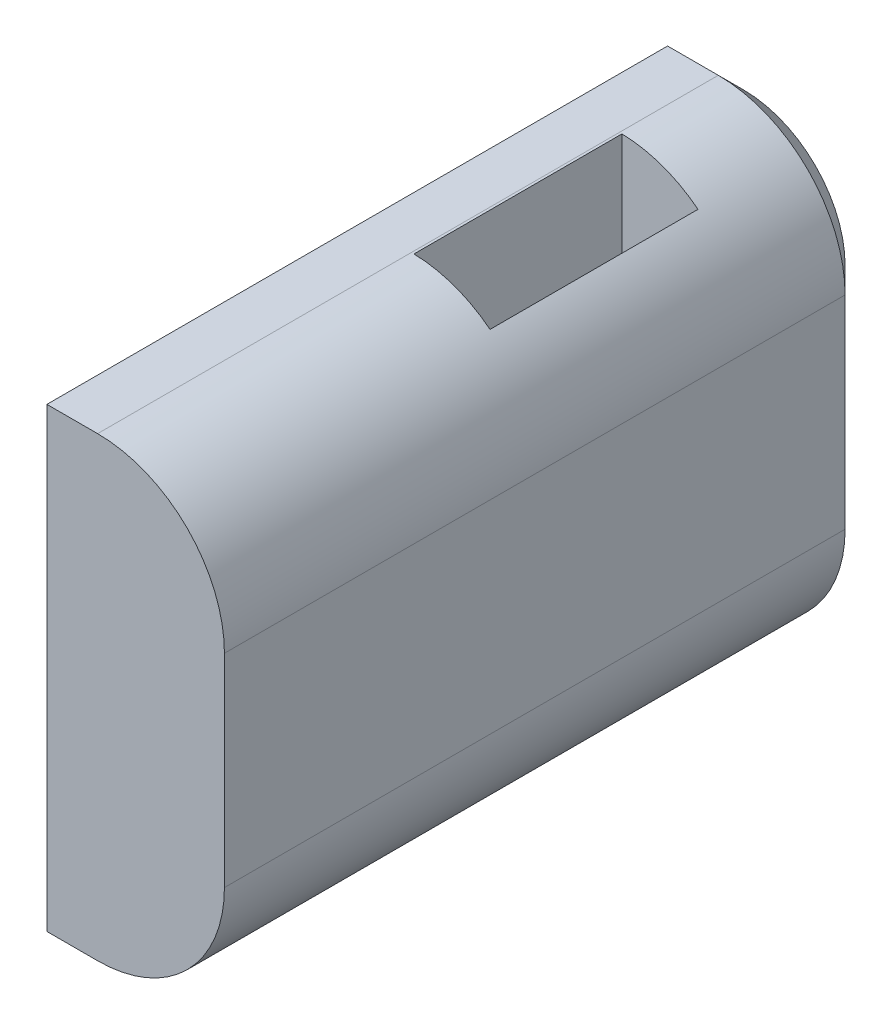
ISO-10303-21;
HEADER;
FILE_DESCRIPTION(('STEP AP214'),'2;1');
FILE_NAME('part.step','',(''),(''),'','','');
FILE_SCHEMA(('AUTOMOTIVE_DESIGN { 1 0 10303 214 1 1 1 1 }'));
ENDSEC;
DATA;
#1=APPLICATION_CONTEXT('core data for automotive mechanical design processes');
#2=APPLICATION_PROTOCOL_DEFINITION('international standard','automotive_design',2000,#1);
#3=PRODUCT_CONTEXT('',#1,'mechanical');
#4=PRODUCT('Part','Part','',(#3));
#5=PRODUCT_RELATED_PRODUCT_CATEGORY('part','',(#4));
#6=PRODUCT_DEFINITION_FORMATION('','',#4);
#7=PRODUCT_DEFINITION_CONTEXT('part definition',#1,'design');
#8=PRODUCT_DEFINITION('design','',#6,#7);
#9=PRODUCT_DEFINITION_SHAPE('','',#8);
#10=(LENGTH_UNIT() NAMED_UNIT(*) SI_UNIT(.MILLI.,.METRE.));
#11=(NAMED_UNIT(*) PLANE_ANGLE_UNIT() SI_UNIT($,.RADIAN.));
#12=(NAMED_UNIT(*) SI_UNIT($,.STERADIAN.) SOLID_ANGLE_UNIT());
#13=UNCERTAINTY_MEASURE_WITH_UNIT(LENGTH_MEASURE(1.E-05),#10,'distance_accuracy_value','');
#14=(GEOMETRIC_REPRESENTATION_CONTEXT(3) GLOBAL_UNCERTAINTY_ASSIGNED_CONTEXT((#13)) GLOBAL_UNIT_ASSIGNED_CONTEXT((#10,
#11,#12)) REPRESENTATION_CONTEXT('',''));
#15=CARTESIAN_POINT('',(0.,0.,0.));
#16=DIRECTION('',(0.,0.,1.));
#17=DIRECTION('',(1.,0.,0.));
#18=AXIS2_PLACEMENT_3D('',#15,#16,#17);
#19=CARTESIAN_POINT('',(93.3781408275814,9.,74.));
#20=DIRECTION('',(0.,1.,0.));
#21=DIRECTION('',(0.,0.,1.));
#22=AXIS2_PLACEMENT_3D('',#19,#20,#21);
#23=PLANE('',#22);
#24=DIRECTION('',(0.,0.,1.));
#25=VECTOR('',#24,1.);
#26=CARTESIAN_POINT('',(69.0576327518926,9.,64.));
#27=LINE('',#26,#25);
#28=CARTESIAN_POINT('',(69.0576327518926,9.,47.));
#29=VERTEX_POINT('',#28);
#30=CARTESIAN_POINT('',(69.0576327518926,9.,71.4726497465378));
#31=VERTEX_POINT('',#30);
#32=EDGE_CURVE('E149',#29,#31,#27,.T.);
#33=ORIENTED_EDGE('',*,*,#32,.T.);
#34=DIRECTION('',(-1.,0.,0.));
#35=VECTOR('',#34,1.);
#36=CARTESIAN_POINT('',(69.0576327518926,9.,71.4726497465378));
#37=LINE('',#36,#35);
#38=CARTESIAN_POINT('',(71.0576327518926,9.00000000000001,71.4726497465378));
#39=VERTEX_POINT('',#38);
#40=EDGE_CURVE('E152',#39,#31,#37,.T.);
#41=ORIENTED_EDGE('',*,*,#40,.F.);
#42=DIRECTION('',(0.,0.,-1.));
#43=VECTOR('',#42,1.);
#44=CARTESIAN_POINT('',(71.0576327518926,9.,46.));
#45=LINE('',#44,#43);
#46=CARTESIAN_POINT('',(71.0576327518926,9.,47.));
#47=VERTEX_POINT('',#46);
#48=EDGE_CURVE('E228',#39,#47,#45,.T.);
#49=ORIENTED_EDGE('',*,*,#48,.T.);
#50=DIRECTION('',(-1.,0.,0.));
#51=VECTOR('',#50,1.);
#52=CARTESIAN_POINT('',(69.0576327518926,9.,47.));
#53=LINE('',#52,#51);
#54=EDGE_CURVE('E154',#47,#29,#53,.T.);
#55=ORIENTED_EDGE('',*,*,#54,.T.);
#56=EDGE_LOOP('',(#33,#41,#49,#55));
#57=FACE_BOUND('',#56,.T.);
#58=ADVANCED_FACE('F45',(#57),#23,.T.);
#59=CARTESIAN_POINT('',(69.0576327518926,9.,64.));
#60=DIRECTION('',(1.,0.,0.));
#61=DIRECTION('',(0.,0.,-1.));
#62=AXIS2_PLACEMENT_3D('',#59,#60,#61);
#63=PLANE('',#62);
#64=CARTESIAN_POINT('',(69.0576327518926,0.000365210210902071,55.));
#65=DIRECTION('',(-1.,0.,0.));
#66=DIRECTION('',(0.,0.,1.));
#67=AXIS2_PLACEMENT_3D('',#64,#65,#66);
#68=CIRCLE('',#67,2.74999999999999);
#69=CARTESIAN_POINT('',(69.0576327518926,0.000365210210902071,57.75));
#70=VERTEX_POINT('',#69);
#71=EDGE_CURVE('E183',#70,#70,#68,.T.);
#72=ORIENTED_EDGE('',*,*,#71,.F.);
#73=EDGE_LOOP('',(#72));
#74=FACE_BOUND('',#73,.T.);
#75=ORIENTED_EDGE('',*,*,#32,.F.);
#76=DIRECTION('',(0.,-1.,0.));
#77=VECTOR('',#76,1.);
#78=CARTESIAN_POINT('',(69.0576327518926,9.,47.));
#79=LINE('',#78,#77);
#80=CARTESIAN_POINT('',(69.0576327518926,-9.,47.));
#81=VERTEX_POINT('',#80);
#82=EDGE_CURVE('E255',#29,#81,#79,.T.);
#83=ORIENTED_EDGE('',*,*,#82,.T.);
#84=DIRECTION('',(0.,0.,1.));
#85=VECTOR('',#84,1.);
#86=CARTESIAN_POINT('',(69.0576327518926,-9.,64.));
#87=LINE('',#86,#85);
#88=CARTESIAN_POINT('',(69.0576327518926,-9.,71.4726497465378));
#89=VERTEX_POINT('',#88);
#90=EDGE_CURVE('E158',#81,#89,#87,.T.);
#91=ORIENTED_EDGE('',*,*,#90,.T.);
#92=DIRECTION('',(0.,-1.,0.));
#93=VECTOR('',#92,1.);
#94=CARTESIAN_POINT('',(69.0576327518926,9.,71.4726497465378));
#95=LINE('',#94,#93);
#96=EDGE_CURVE('E161',#31,#89,#95,.T.);
#97=ORIENTED_EDGE('',*,*,#96,.F.);
#98=EDGE_LOOP('',(#75,#83,#91,#97));
#99=FACE_BOUND('',#98,.T.);
#100=ADVANCED_FACE('F162',(#74,#99),#63,.F.);
#101=CARTESIAN_POINT('',(76.0576327518926,9.,46.));
#102=DIRECTION('',(-1.,0.,0.));
#103=DIRECTION('',(0.,0.,1.));
#104=AXIS2_PLACEMENT_3D('',#101,#102,#103);
#105=PLANE('',#104);
#106=DIRECTION('',(0.,0.,-1.));
#107=VECTOR('',#106,1.);
#108=CARTESIAN_POINT('',(76.0576327518926,4.,100.));
#109=LINE('',#108,#107);
#110=CARTESIAN_POINT('',(76.0576327518926,4.,47.));
#111=VERTEX_POINT('',#110);
#112=CARTESIAN_POINT('',(76.0576327518926,4.,71.4726497465378));
#113=VERTEX_POINT('',#112);
#114=EDGE_CURVE('E157',#111,#113,#109,.F.);
#115=ORIENTED_EDGE('',*,*,#114,.T.);
#116=DIRECTION('',(0.,1.,0.));
#117=VECTOR('',#116,1.);
#118=CARTESIAN_POINT('',(76.0576327518926,4.,71.4726497465378));
#119=LINE('',#118,#117);
#120=CARTESIAN_POINT('',(76.0576327518926,-4.,71.4726497465378));
#121=VERTEX_POINT('',#120);
#122=EDGE_CURVE('E179',#121,#113,#119,.T.);
#123=ORIENTED_EDGE('',*,*,#122,.F.);
#124=DIRECTION('',(0.,0.,-1.));
#125=VECTOR('',#124,1.);
#126=CARTESIAN_POINT('',(76.0576327518926,-4.,46.));
#127=LINE('',#126,#125);
#128=CARTESIAN_POINT('',(76.0576327518926,-4.,47.));
#129=VERTEX_POINT('',#128);
#130=EDGE_CURVE('E62',#121,#129,#127,.T.);
#131=ORIENTED_EDGE('',*,*,#130,.T.);
#132=DIRECTION('',(0.,1.,0.));
#133=VECTOR('',#132,1.);
#134=CARTESIAN_POINT('',(76.0576327518926,9.,47.));
#135=LINE('',#134,#133);
#136=EDGE_CURVE('E11',#129,#111,#135,.T.);
#137=ORIENTED_EDGE('',*,*,#136,.T.);
#138=EDGE_LOOP('',(#115,#123,#131,#137));
#139=FACE_BOUND('',#138,.T.);
#140=ADVANCED_FACE('F289',(#139),#105,.F.);
#141=CARTESIAN_POINT('',(69.0576327518926,9.,46.));
#142=DIRECTION('',(0.,0.,1.));
#143=DIRECTION('',(1.,0.,0.));
#144=AXIS2_PLACEMENT_3D('',#141,#142,#143);
#145=PLANE('',#144);
#146=DIRECTION('',(1.,0.,0.));
#147=VECTOR('',#146,1.);
#148=CARTESIAN_POINT('',(71.0576327518926,8.00000000000001,46.));
#149=LINE('',#148,#147);
#150=CARTESIAN_POINT('',(70.0576327518926,8.00000000000001,46.));
#151=VERTEX_POINT('',#150);
#152=CARTESIAN_POINT('',(71.0576327518926,8.00000000000001,46.));
#153=VERTEX_POINT('',#152);
#154=EDGE_CURVE('E246',#151,#153,#149,.T.);
#155=ORIENTED_EDGE('',*,*,#154,.T.);
#156=CARTESIAN_POINT('',(71.0576327518926,4.,46.));
#157=DIRECTION('',(0.,0.,1.));
#158=DIRECTION('',(1.,0.,0.));
#159=AXIS2_PLACEMENT_3D('',#156,#157,#158);
#160=CIRCLE('',#159,4.00000000000002);
#161=CARTESIAN_POINT('',(75.0576327518926,4.,46.));
#162=VERTEX_POINT('',#161);
#163=EDGE_CURVE('E248',#153,#162,#160,.F.);
#164=ORIENTED_EDGE('',*,*,#163,.T.);
#165=DIRECTION('',(0.,-1.,0.));
#166=VECTOR('',#165,1.);
#167=CARTESIAN_POINT('',(75.0576327518926,9.,46.));
#168=LINE('',#167,#166);
#169=CARTESIAN_POINT('',(75.0576327518926,-4.,46.));
#170=VERTEX_POINT('',#169);
#171=EDGE_CURVE('E230',#162,#170,#168,.T.);
#172=ORIENTED_EDGE('',*,*,#171,.T.);
#173=CARTESIAN_POINT('',(71.0576327518926,-4.,46.));
#174=DIRECTION('',(0.,0.,1.));
#175=DIRECTION('',(1.,0.,0.));
#176=AXIS2_PLACEMENT_3D('',#173,#174,#175);
#177=CIRCLE('',#176,4.00000000000001);
#178=CARTESIAN_POINT('',(71.0576327518926,-8.00000000000001,46.));
#179=VERTEX_POINT('',#178);
#180=EDGE_CURVE('E240',#170,#179,#177,.F.);
#181=ORIENTED_EDGE('',*,*,#180,.T.);
#182=DIRECTION('',(-1.,0.,0.));
#183=VECTOR('',#182,1.);
#184=CARTESIAN_POINT('',(69.0576327518926,-8.00000000000001,46.));
#185=LINE('',#184,#183);
#186=CARTESIAN_POINT('',(70.0576327518926,-8.00000000000001,46.));
#187=VERTEX_POINT('',#186);
#188=EDGE_CURVE('E242',#179,#187,#185,.T.);
#189=ORIENTED_EDGE('',*,*,#188,.T.);
#190=DIRECTION('',(0.,1.,0.));
#191=VECTOR('',#190,1.);
#192=CARTESIAN_POINT('',(70.0576327518926,9.,46.));
#193=LINE('',#192,#191);
#194=EDGE_CURVE('E244',#187,#151,#193,.T.);
#195=ORIENTED_EDGE('',*,*,#194,.T.);
#196=EDGE_LOOP('',(#155,#164,#172,#181,#189,#195));
#197=FACE_BOUND('',#196,.T.);
#198=ADVANCED_FACE('F304',(#197),#145,.F.);
#199=CARTESIAN_POINT('',(93.3781408275814,-9.,74.));
#200=DIRECTION('',(0.,1.,0.));
#201=DIRECTION('',(0.,0.,1.));
#202=AXIS2_PLACEMENT_3D('',#199,#200,#201);
#203=PLANE('',#202);
#204=DIRECTION('',(0.,0.,-1.));
#205=VECTOR('',#204,1.);
#206=CARTESIAN_POINT('',(71.0576327518926,-9.,74.));
#207=LINE('',#206,#205);
#208=CARTESIAN_POINT('',(71.0576327518926,-9.,47.));
#209=VERTEX_POINT('',#208);
#210=CARTESIAN_POINT('',(71.0576327518926,-9.,71.4726497465378));
#211=VERTEX_POINT('',#210);
#212=EDGE_CURVE('E226',#209,#211,#207,.F.);
#213=ORIENTED_EDGE('',*,*,#212,.T.);
#214=DIRECTION('',(1.,0.,0.));
#215=VECTOR('',#214,1.);
#216=CARTESIAN_POINT('',(69.0576327518926,-9.,71.4726497465378));
#217=LINE('',#216,#215);
#218=EDGE_CURVE('E166',#89,#211,#217,.T.);
#219=ORIENTED_EDGE('',*,*,#218,.F.);
#220=ORIENTED_EDGE('',*,*,#90,.F.);
#221=DIRECTION('',(1.,0.,0.));
#222=VECTOR('',#221,1.);
#223=CARTESIAN_POINT('',(93.3781408275814,-9.,47.));
#224=LINE('',#223,#222);
#225=EDGE_CURVE('E70',#81,#209,#224,.T.);
#226=ORIENTED_EDGE('',*,*,#225,.T.);
#227=EDGE_LOOP('',(#213,#219,#220,#226));
#228=FACE_BOUND('',#227,.T.);
#229=ADVANCED_FACE('F288',(#228),#203,.F.);
#230=CARTESIAN_POINT('',(74.1576327518926,-2.4,59.1));
#231=DIRECTION('',(0.,0.,1.));
#232=DIRECTION('',(1.,0.,0.));
#233=AXIS2_PLACEMENT_3D('',#230,#231,#232);
#234=PLANE('',#233);
#235=DIRECTION('',(0.,1.,0.));
#236=VECTOR('',#235,1.);
#237=CARTESIAN_POINT('',(71.1576327518926,-2.4,59.1));
#238=LINE('',#237,#236);
#239=CARTESIAN_POINT('',(71.1576327518926,-2.4,59.1));
#240=VERTEX_POINT('',#239);
#241=CARTESIAN_POINT('',(71.1576327518926,8.99899989997999,59.1));
#242=VERTEX_POINT('',#241);
#243=EDGE_CURVE('E211',#240,#242,#238,.T.);
#244=ORIENTED_EDGE('',*,*,#243,.T.);
#245=CARTESIAN_POINT('',(71.0576327518926,4.,59.1));
#246=DIRECTION('',(0.,0.,1.));
#247=DIRECTION('',(1.,0.,0.));
#248=AXIS2_PLACEMENT_3D('',#245,#246,#247);
#249=CIRCLE('',#248,5.);
#250=CARTESIAN_POINT('',(74.1576327518926,7.9230090491866,59.1));
#251=VERTEX_POINT('',#250);
#252=EDGE_CURVE('E216',#251,#242,#249,.T.);
#253=ORIENTED_EDGE('',*,*,#252,.F.);
#254=DIRECTION('',(0.,1.,0.));
#255=VECTOR('',#254,1.);
#256=CARTESIAN_POINT('',(74.1576327518926,-2.4,59.1));
#257=LINE('',#256,#255);
#258=CARTESIAN_POINT('',(74.1576327518926,-2.4,59.1));
#259=VERTEX_POINT('',#258);
#260=EDGE_CURVE('E197',#259,#251,#257,.T.);
#261=ORIENTED_EDGE('',*,*,#260,.F.);
#262=DIRECTION('',(-1.,0.,0.));
#263=VECTOR('',#262,1.);
#264=CARTESIAN_POINT('',(74.1576327518926,-2.4,59.1));
#265=LINE('',#264,#263);
#266=EDGE_CURVE('E214',#259,#240,#265,.T.);
#267=ORIENTED_EDGE('',*,*,#266,.T.);
#268=EDGE_LOOP('',(#244,#253,#261,#267));
#269=FACE_BOUND('',#268,.T.);
#270=ADVANCED_FACE('F330',(#269),#234,.F.);
#271=CARTESIAN_POINT('',(74.1576327518926,-4.69782505861521,55.));
#272=DIRECTION('',(0.,-0.872340425531915,0.488898948641535));
#273=DIRECTION('',(0.,-0.488898948641535,-0.872340425531915));
#274=AXIS2_PLACEMENT_3D('',#271,#272,#273);
#275=PLANE('',#274);
#276=DIRECTION('',(0.,0.488898948641535,0.872340425531915));
#277=VECTOR('',#276,1.);
#278=CARTESIAN_POINT('',(71.1576327518926,-4.69782505861521,55.));
#279=LINE('',#278,#277);
#280=CARTESIAN_POINT('',(71.1576327518926,-4.69782505861521,55.));
#281=VERTEX_POINT('',#280);
#282=EDGE_CURVE('E208',#281,#240,#279,.T.);
#283=ORIENTED_EDGE('',*,*,#282,.T.);
#284=ORIENTED_EDGE('',*,*,#266,.F.);
#285=DIRECTION('',(0.,0.488898948641535,0.872340425531915));
#286=VECTOR('',#285,1.);
#287=CARTESIAN_POINT('',(74.1576327518926,-4.69782505861521,55.));
#288=LINE('',#287,#286);
#289=CARTESIAN_POINT('',(74.1576327518926,-4.69782505861521,55.));
#290=VERTEX_POINT('',#289);
#291=EDGE_CURVE('E194',#290,#259,#288,.T.);
#292=ORIENTED_EDGE('',*,*,#291,.F.);
#293=DIRECTION('',(-1.,0.,0.));
#294=VECTOR('',#293,1.);
#295=CARTESIAN_POINT('',(74.1576327518926,-4.69782505861521,55.));
#296=LINE('',#295,#294);
#297=EDGE_CURVE('E217',#290,#281,#296,.T.);
#298=ORIENTED_EDGE('',*,*,#297,.T.);
#299=EDGE_LOOP('',(#283,#284,#292,#298));
#300=FACE_BOUND('',#299,.T.);
#301=ADVANCED_FACE('F416',(#300),#275,.F.);
#302=CARTESIAN_POINT('',(74.1576327518926,-2.4,50.9));
#303=DIRECTION('',(0.,-0.872340425531915,-0.488898948641535));
#304=DIRECTION('',(0.,0.488898948641535,-0.872340425531915));
#305=AXIS2_PLACEMENT_3D('',#302,#303,#304);
#306=PLANE('',#305);
#307=DIRECTION('',(0.,-0.488898948641535,0.872340425531915));
#308=VECTOR('',#307,1.);
#309=CARTESIAN_POINT('',(71.1576327518926,-2.4,50.9));
#310=LINE('',#309,#308);
#311=CARTESIAN_POINT('',(71.1576327518926,-2.4,50.9));
#312=VERTEX_POINT('',#311);
#313=EDGE_CURVE('E204',#312,#281,#310,.T.);
#314=ORIENTED_EDGE('',*,*,#313,.T.);
#315=ORIENTED_EDGE('',*,*,#297,.F.);
#316=DIRECTION('',(0.,-0.488898948641535,0.872340425531915));
#317=VECTOR('',#316,1.);
#318=CARTESIAN_POINT('',(74.1576327518926,-2.4,50.9));
#319=LINE('',#318,#317);
#320=CARTESIAN_POINT('',(74.1576327518926,-2.4,50.9));
#321=VERTEX_POINT('',#320);
#322=EDGE_CURVE('E190',#321,#290,#319,.T.);
#323=ORIENTED_EDGE('',*,*,#322,.F.);
#324=DIRECTION('',(-1.,0.,0.));
#325=VECTOR('',#324,1.);
#326=CARTESIAN_POINT('',(74.1576327518926,-2.4,50.9));
#327=LINE('',#326,#325);
#328=EDGE_CURVE('E219',#321,#312,#327,.T.);
#329=ORIENTED_EDGE('',*,*,#328,.T.);
#330=EDGE_LOOP('',(#314,#315,#323,#329));
#331=FACE_BOUND('',#330,.T.);
#332=ADVANCED_FACE('F408',(#331),#306,.F.);
#333=CARTESIAN_POINT('',(74.1576327518926,9.,50.9));
#334=DIRECTION('',(0.,0.,-1.));
#335=DIRECTION('',(-1.,0.,0.));
#336=AXIS2_PLACEMENT_3D('',#333,#334,#335);
#337=PLANE('',#336);
#338=DIRECTION('',(0.,-1.,0.));
#339=VECTOR('',#338,1.);
#340=CARTESIAN_POINT('',(71.1576327518926,9.,50.9));
#341=LINE('',#340,#339);
#342=CARTESIAN_POINT('',(71.1576327518926,8.99899989997999,50.9));
#343=VERTEX_POINT('',#342);
#344=EDGE_CURVE('E201',#343,#312,#341,.T.);
#345=ORIENTED_EDGE('',*,*,#344,.T.);
#346=ORIENTED_EDGE('',*,*,#328,.F.);
#347=DIRECTION('',(0.,-1.,0.));
#348=VECTOR('',#347,1.);
#349=CARTESIAN_POINT('',(74.1576327518926,9.,50.9));
#350=LINE('',#349,#348);
#351=CARTESIAN_POINT('',(74.1576327518926,7.9230090491866,50.9));
#352=VERTEX_POINT('',#351);
#353=EDGE_CURVE('E187',#352,#321,#350,.T.);
#354=ORIENTED_EDGE('',*,*,#353,.F.);
#355=CARTESIAN_POINT('',(71.0576327518926,4.,50.9));
#356=DIRECTION('',(0.,0.,-1.));
#357=DIRECTION('',(-1.,0.,0.));
#358=AXIS2_PLACEMENT_3D('',#355,#356,#357);
#359=CIRCLE('',#358,5.);
#360=EDGE_CURVE('E200',#352,#343,#359,.F.);
#361=ORIENTED_EDGE('',*,*,#360,.T.);
#362=EDGE_LOOP('',(#345,#346,#354,#361));
#363=FACE_BOUND('',#362,.T.);
#364=ADVANCED_FACE('F326',(#363),#337,.F.);
#365=CARTESIAN_POINT('',(74.1576327518926,0.,0.));
#366=DIRECTION('',(-1.,0.,0.));
#367=DIRECTION('',(0.,0.,1.));
#368=AXIS2_PLACEMENT_3D('',#365,#366,#367);
#369=PLANE('',#368);
#370=DIRECTION('',(0.,0.,1.));
#371=VECTOR('',#370,1.);
#372=CARTESIAN_POINT('',(74.1576327518926,7.9230090491866,55.));
#373=LINE('',#372,#371);
#374=EDGE_CURVE('E191',#251,#352,#373,.F.);
#375=ORIENTED_EDGE('',*,*,#374,.T.);
#376=ORIENTED_EDGE('',*,*,#353,.T.);
#377=ORIENTED_EDGE('',*,*,#322,.T.);
#378=ORIENTED_EDGE('',*,*,#291,.T.);
#379=ORIENTED_EDGE('',*,*,#260,.T.);
#380=EDGE_LOOP('',(#375,#376,#377,#378,#379));
#381=FACE_BOUND('',#380,.T.);
#382=ADVANCED_FACE('F391',(#381),#369,.T.);
#383=CARTESIAN_POINT('',(71.1576327518926,0.,0.));
#384=DIRECTION('',(-1.,0.,0.));
#385=DIRECTION('',(0.,0.,1.));
#386=AXIS2_PLACEMENT_3D('',#383,#384,#385);
#387=PLANE('',#386);
#388=CARTESIAN_POINT('',(71.1576327518926,0.000365210210902071,55.));
#389=DIRECTION('',(-1.,0.,0.));
#390=DIRECTION('',(0.,0.,1.));
#391=AXIS2_PLACEMENT_3D('',#388,#389,#390);
#392=CIRCLE('',#391,2.74999999999999);
#393=CARTESIAN_POINT('',(71.1576327518926,0.000365210210902071,57.75));
#394=VERTEX_POINT('',#393);
#395=EDGE_CURVE('E186',#394,#394,#392,.T.);
#396=ORIENTED_EDGE('',*,*,#395,.T.);
#397=EDGE_LOOP('',(#396));
#398=FACE_BOUND('',#397,.T.);
#399=DIRECTION('',(0.,0.,1.));
#400=VECTOR('',#399,1.);
#401=CARTESIAN_POINT('',(71.1576327518926,8.99899989997999,55.));
#402=LINE('',#401,#400);
#403=EDGE_CURVE('E205',#242,#343,#402,.F.);
#404=ORIENTED_EDGE('',*,*,#403,.F.);
#405=ORIENTED_EDGE('',*,*,#243,.F.);
#406=ORIENTED_EDGE('',*,*,#282,.F.);
#407=ORIENTED_EDGE('',*,*,#313,.F.);
#408=ORIENTED_EDGE('',*,*,#344,.F.);
#409=EDGE_LOOP('',(#404,#405,#406,#407,#408));
#410=FACE_BOUND('',#409,.T.);
#411=ADVANCED_FACE('F381',(#398,#410),#387,.F.);
#412=CARTESIAN_POINT('',(69.0576327518926,0.000365210210902071,55.));
#413=DIRECTION('',(-1.,0.,0.));
#414=DIRECTION('',(0.,0.,1.));
#415=AXIS2_PLACEMENT_3D('',#412,#413,#414);
#416=CYLINDRICAL_SURFACE('',#415,2.74999999999999);
#417=ORIENTED_EDGE('',*,*,#71,.T.);
#418=EDGE_LOOP('',(#417));
#419=FACE_BOUND('',#418,.T.);
#420=ORIENTED_EDGE('',*,*,#395,.F.);
#421=EDGE_LOOP('',(#420));
#422=FACE_BOUND('',#421,.T.);
#423=ADVANCED_FACE('F339',(#419,#422),#416,.F.);
#424=CARTESIAN_POINT('',(71.0576327518926,4.,74.));
#425=DIRECTION('',(0.,0.,1.));
#426=DIRECTION('',(1.,0.,0.));
#427=AXIS2_PLACEMENT_3D('',#424,#425,#426);
#428=CYLINDRICAL_SURFACE('',#427,5.);
#429=ORIENTED_EDGE('',*,*,#48,.F.);
#430=CARTESIAN_POINT('',(71.0576327518926,3.99999999999999,71.4726497465378));
#431=DIRECTION('',(0.,0.,1.));
#432=DIRECTION('',(-1.,0.,0.));
#433=AXIS2_PLACEMENT_3D('',#430,#431,#432);
#434=CIRCLE('',#433,5.00000000000001);
#435=EDGE_CURVE('E172',#113,#39,#434,.T.);
#436=ORIENTED_EDGE('',*,*,#435,.F.);
#437=ORIENTED_EDGE('',*,*,#114,.F.);
#438=CARTESIAN_POINT('',(71.0576327518926,4.,47.));
#439=DIRECTION('',(0.,0.,1.));
#440=DIRECTION('',(1.,0.,0.));
#441=AXIS2_PLACEMENT_3D('',#438,#439,#440);
#442=CIRCLE('',#441,5.);
#443=EDGE_CURVE('E251',#111,#47,#442,.T.);
#444=ORIENTED_EDGE('',*,*,#443,.T.);
#445=EDGE_LOOP('',(#429,#436,#437,#444));
#446=FACE_BOUND('',#445,.T.);
#447=ORIENTED_EDGE('',*,*,#360,.F.);
#448=ORIENTED_EDGE('',*,*,#374,.F.);
#449=ORIENTED_EDGE('',*,*,#252,.T.);
#450=ORIENTED_EDGE('',*,*,#403,.T.);
#451=EDGE_LOOP('',(#447,#448,#449,#450));
#452=FACE_BOUND('',#451,.T.);
#453=ADVANCED_FACE('F293',(#446,#452),#428,.T.);
#454=CARTESIAN_POINT('',(71.0576327518926,-4.,46.));
#455=DIRECTION('',(0.,0.,-1.));
#456=DIRECTION('',(-1.,0.,0.));
#457=AXIS2_PLACEMENT_3D('',#454,#455,#456);
#458=CYLINDRICAL_SURFACE('',#457,5.);
#459=ORIENTED_EDGE('',*,*,#130,.F.);
#460=CARTESIAN_POINT('',(71.0576327518926,-4.,71.4726497465378));
#461=DIRECTION('',(0.,0.,1.));
#462=DIRECTION('',(-1.,0.,0.));
#463=AXIS2_PLACEMENT_3D('',#460,#461,#462);
#464=CIRCLE('',#463,5.);
#465=EDGE_CURVE('E176',#211,#121,#464,.T.);
#466=ORIENTED_EDGE('',*,*,#465,.F.);
#467=ORIENTED_EDGE('',*,*,#212,.F.);
#468=CARTESIAN_POINT('',(71.0576327518926,-4.,47.));
#469=DIRECTION('',(0.,0.,1.));
#470=DIRECTION('',(1.,0.,0.));
#471=AXIS2_PLACEMENT_3D('',#468,#469,#470);
#472=CIRCLE('',#471,5.);
#473=EDGE_CURVE('E55',#209,#129,#472,.T.);
#474=ORIENTED_EDGE('',*,*,#473,.T.);
#475=EDGE_LOOP('',(#459,#466,#467,#474));
#476=FACE_BOUND('',#475,.T.);
#477=ADVANCED_FACE('F286',(#476),#458,.T.);
#478=CARTESIAN_POINT('',(69.0576327518926,-8.00000000000001,46.));
#479=DIRECTION('',(0.,0.70710678118655,0.707106781186545));
#480=DIRECTION('',(-1.,0.,0.));
#481=AXIS2_PLACEMENT_3D('',#478,#479,#480);
#482=PLANE('',#481);
#483=DIRECTION('',(0.,0.707106781186545,-0.70710678118655));
#484=VECTOR('',#483,1.);
#485=CARTESIAN_POINT('',(71.0576327518926,-9.,47.));
#486=LINE('',#485,#484);
#487=EDGE_CURVE('E268',#209,#179,#486,.T.);
#488=ORIENTED_EDGE('',*,*,#487,.F.);
#489=ORIENTED_EDGE('',*,*,#225,.F.);
#490=DIRECTION('',(0.577350269189625,0.577350269189625,-0.577350269189629));
#491=VECTOR('',#490,1.);
#492=CARTESIAN_POINT('',(69.7242994185592,-8.33333333333334,46.3333333333333));
#493=LINE('',#492,#491);
#494=EDGE_CURVE('E50',#187,#81,#493,.F.);
#495=ORIENTED_EDGE('',*,*,#494,.F.);
#496=ORIENTED_EDGE('',*,*,#188,.F.);
#497=EDGE_LOOP('',(#488,#489,#495,#496));
#498=FACE_BOUND('',#497,.T.);
#499=ADVANCED_FACE('F48',(#498),#482,.F.);
#500=CARTESIAN_POINT('',(69.0576327518926,9.,47.));
#501=DIRECTION('',(0.70710678118655,0.,0.707106781186545));
#502=DIRECTION('',(0.,-1.,0.));
#503=AXIS2_PLACEMENT_3D('',#500,#501,#502);
#504=PLANE('',#503);
#505=ORIENTED_EDGE('',*,*,#494,.T.);
#506=ORIENTED_EDGE('',*,*,#82,.F.);
#507=DIRECTION('',(-0.577350269189625,0.577350269189625,0.577350269189629));
#508=VECTOR('',#507,1.);
#509=CARTESIAN_POINT('',(69.0576327518926,9.,47.));
#510=LINE('',#509,#508);
#511=EDGE_CURVE('E266',#151,#29,#510,.T.);
#512=ORIENTED_EDGE('',*,*,#511,.F.);
#513=ORIENTED_EDGE('',*,*,#194,.F.);
#514=EDGE_LOOP('',(#505,#506,#512,#513));
#515=FACE_BOUND('',#514,.T.);
#516=ADVANCED_FACE('F278',(#515),#504,.F.);
#517=CARTESIAN_POINT('',(71.0576327518926,-4.,46.));
#518=DIRECTION('',(0.,0.,1.));
#519=DIRECTION('',(1.,0.,0.));
#520=AXIS2_PLACEMENT_3D('',#517,#518,#519);
#521=CONICAL_SURFACE('',#520,4.00000000000001,0.785398163397444);
#522=ORIENTED_EDGE('',*,*,#487,.T.);
#523=ORIENTED_EDGE('',*,*,#180,.F.);
#524=DIRECTION('',(-0.707106781186545,0.,-0.70710678118655));
#525=VECTOR('',#524,1.);
#526=CARTESIAN_POINT('',(76.0576327518926,-4.,47.));
#527=LINE('',#526,#525);
#528=EDGE_CURVE('E263',#129,#170,#527,.T.);
#529=ORIENTED_EDGE('',*,*,#528,.F.);
#530=ORIENTED_EDGE('',*,*,#473,.F.);
#531=EDGE_LOOP('',(#522,#523,#529,#530));
#532=FACE_BOUND('',#531,.T.);
#533=ADVANCED_FACE('F283',(#532),#521,.T.);
#534=CARTESIAN_POINT('',(93.3781408275814,9.,47.));
#535=DIRECTION('',(0.,0.70710678118655,-0.707106781186545));
#536=DIRECTION('',(1.,0.,0.));
#537=AXIS2_PLACEMENT_3D('',#534,#535,#536);
#538=PLANE('',#537);
#539=ORIENTED_EDGE('',*,*,#511,.T.);
#540=ORIENTED_EDGE('',*,*,#54,.F.);
#541=DIRECTION('',(0.,0.707106781186545,0.70710678118655));
#542=VECTOR('',#541,1.);
#543=CARTESIAN_POINT('',(71.0576327518926,8.00000000000001,46.));
#544=LINE('',#543,#542);
#545=EDGE_CURVE('E260',#153,#47,#544,.T.);
#546=ORIENTED_EDGE('',*,*,#545,.F.);
#547=ORIENTED_EDGE('',*,*,#154,.F.);
#548=EDGE_LOOP('',(#539,#540,#546,#547));
#549=FACE_BOUND('',#548,.T.);
#550=ADVANCED_FACE('F307',(#549),#538,.T.);
#551=CARTESIAN_POINT('',(75.0576327518926,9.,46.));
#552=DIRECTION('',(-0.70710678118655,0.,0.707106781186545));
#553=DIRECTION('',(0.,-1.,0.));
#554=AXIS2_PLACEMENT_3D('',#551,#552,#553);
#555=PLANE('',#554);
#556=ORIENTED_EDGE('',*,*,#528,.T.);
#557=ORIENTED_EDGE('',*,*,#171,.F.);
#558=DIRECTION('',(-0.707106781186545,0.,-0.70710678118655));
#559=VECTOR('',#558,1.);
#560=CARTESIAN_POINT('',(76.0576327518926,4.,47.));
#561=LINE('',#560,#559);
#562=EDGE_CURVE('E182',#111,#162,#561,.T.);
#563=ORIENTED_EDGE('',*,*,#562,.F.);
#564=ORIENTED_EDGE('',*,*,#136,.F.);
#565=EDGE_LOOP('',(#556,#557,#563,#564));
#566=FACE_BOUND('',#565,.T.);
#567=ADVANCED_FACE('F302',(#566),#555,.F.);
#568=CARTESIAN_POINT('',(71.0576327518926,4.,46.));
#569=DIRECTION('',(0.,0.,1.));
#570=DIRECTION('',(1.,0.,0.));
#571=AXIS2_PLACEMENT_3D('',#568,#569,#570);
#572=CONICAL_SURFACE('',#571,4.00000000000002,0.785398163397443);
#573=ORIENTED_EDGE('',*,*,#545,.T.);
#574=ORIENTED_EDGE('',*,*,#443,.F.);
#575=ORIENTED_EDGE('',*,*,#562,.T.);
#576=ORIENTED_EDGE('',*,*,#163,.F.);
#577=EDGE_LOOP('',(#573,#574,#575,#576));
#578=FACE_BOUND('',#577,.T.);
#579=ADVANCED_FACE('F297',(#578),#572,.T.);
#580=CARTESIAN_POINT('',(71.0576327518926,3.99999999999999,71.4726497465378));
#581=DIRECTION('',(0.,0.,-1.));
#582=DIRECTION('',(-1.,0.,0.));
#583=AXIS2_PLACEMENT_3D('',#580,#581,#582);
#584=PLANE('',#583);
#585=ORIENTED_EDGE('',*,*,#40,.T.);
#586=ORIENTED_EDGE('',*,*,#96,.T.);
#587=ORIENTED_EDGE('',*,*,#218,.T.);
#588=ORIENTED_EDGE('',*,*,#465,.T.);
#589=ORIENTED_EDGE('',*,*,#122,.T.);
#590=ORIENTED_EDGE('',*,*,#435,.T.);
#591=EDGE_LOOP('',(#585,#586,#587,#588,#589,#590));
#592=FACE_BOUND('',#591,.T.);
#593=ADVANCED_FACE('F169',(#592),#584,.F.);
#594=CLOSED_SHELL('',(#58,#100,#140,#198,#229,#270,#301,#332,#364,#382,#411,#423,#453,#477,#499,
#516,#533,#550,#567,#579,#593));
#595=MANIFOLD_SOLID_BREP('B2',#594);
#596=ADVANCED_BREP_SHAPE_REPRESENTATION('',(#18,#595),#14);
#597=SHAPE_DEFINITION_REPRESENTATION(#9,#596);
ENDSEC;
END-ISO-10303-21;
